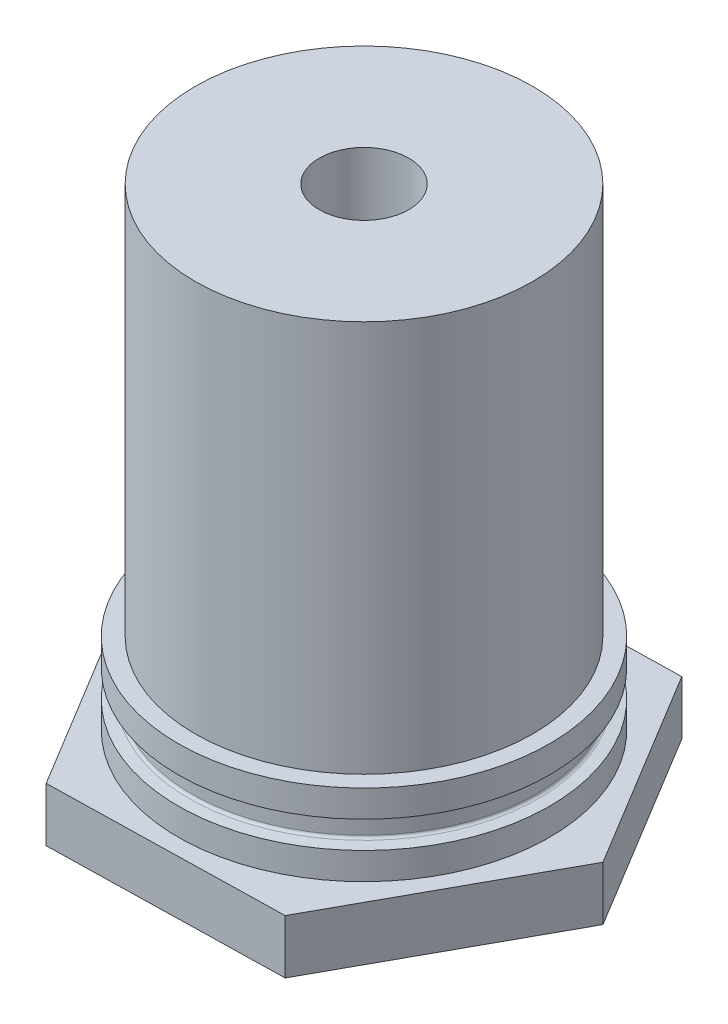
ISO-10303-21;
HEADER;
FILE_DESCRIPTION(('STEP AP214'),'2;1');
FILE_NAME('part.step','',(''),(''),'','','');
FILE_SCHEMA(('AUTOMOTIVE_DESIGN { 1 0 10303 214 1 1 1 1 }'));
ENDSEC;
DATA;
#1=APPLICATION_CONTEXT('core data for automotive mechanical design processes');
#2=APPLICATION_PROTOCOL_DEFINITION('international standard','automotive_design',2000,#1);
#3=PRODUCT_CONTEXT('',#1,'mechanical');
#4=PRODUCT('Part','Part','',(#3));
#5=PRODUCT_RELATED_PRODUCT_CATEGORY('part','',(#4));
#6=PRODUCT_DEFINITION_FORMATION('','',#4);
#7=PRODUCT_DEFINITION_CONTEXT('part definition',#1,'design');
#8=PRODUCT_DEFINITION('design','',#6,#7);
#9=PRODUCT_DEFINITION_SHAPE('','',#8);
#10=(LENGTH_UNIT() NAMED_UNIT(*) SI_UNIT(.MILLI.,.METRE.));
#11=(NAMED_UNIT(*) PLANE_ANGLE_UNIT() SI_UNIT($,.RADIAN.));
#12=(NAMED_UNIT(*) SI_UNIT($,.STERADIAN.) SOLID_ANGLE_UNIT());
#13=UNCERTAINTY_MEASURE_WITH_UNIT(LENGTH_MEASURE(1.E-05),#10,'distance_accuracy_value','');
#14=(GEOMETRIC_REPRESENTATION_CONTEXT(3) GLOBAL_UNCERTAINTY_ASSIGNED_CONTEXT((#13)) GLOBAL_UNIT_ASSIGNED_CONTEXT((#10,
#11,#12)) REPRESENTATION_CONTEXT('',''));
#15=CARTESIAN_POINT('',(0.,0.,0.));
#16=DIRECTION('',(0.,0.,1.));
#17=DIRECTION('',(1.,0.,0.));
#18=AXIS2_PLACEMENT_3D('',#15,#16,#17);
#19=CARTESIAN_POINT('',(0.,110.151211274222,0.));
#20=DIRECTION('',(0.,1.,0.));
#21=DIRECTION('',(0.,0.,1.));
#22=AXIS2_PLACEMENT_3D('',#19,#20,#21);
#23=CYLINDRICAL_SURFACE('',#22,17.4625);
#24=CARTESIAN_POINT('',(0.,5.08192526756477,0.));
#25=DIRECTION('',(0.,1.,0.));
#26=DIRECTION('',(0.,0.,1.));
#27=AXIS2_PLACEMENT_3D('',#24,#25,#26);
#28=CIRCLE('',#27,17.4625);
#29=CARTESIAN_POINT('',(0.,5.08192526756477,17.4625));
#30=VERTEX_POINT('',#29);
#31=EDGE_CURVE('E40',#30,#30,#28,.F.);
#32=ORIENTED_EDGE('',*,*,#31,.F.);
#33=EDGE_LOOP('',(#32));
#34=FACE_BOUND('',#33,.T.);
#35=CARTESIAN_POINT('',(0.,7.62,0.));
#36=DIRECTION('',(0.,1.,0.));
#37=DIRECTION('',(0.,0.,1.));
#38=AXIS2_PLACEMENT_3D('',#35,#36,#37);
#39=CIRCLE('',#38,17.4625);
#40=CARTESIAN_POINT('',(0.,7.62,17.4625));
#41=VERTEX_POINT('',#40);
#42=EDGE_CURVE('E153',#41,#41,#39,.T.);
#43=ORIENTED_EDGE('',*,*,#42,.F.);
#44=EDGE_LOOP('',(#43));
#45=FACE_BOUND('',#44,.T.);
#46=ADVANCED_FACE('F36',(#34,#45),#23,.T.);
#47=CARTESIAN_POINT('',(0.,110.151211274222,0.));
#48=DIRECTION('',(0.,1.,0.));
#49=DIRECTION('',(0.,0.,1.));
#50=AXIS2_PLACEMENT_3D('',#47,#48,#49);
#51=CYLINDRICAL_SURFACE('',#50,4.2037);
#52=CARTESIAN_POINT('',(0.,44.45,0.));
#53=DIRECTION('',(0.,1.,0.));
#54=DIRECTION('',(0.,0.,1.));
#55=AXIS2_PLACEMENT_3D('',#52,#53,#54);
#56=CIRCLE('',#55,4.2037);
#57=CARTESIAN_POINT('',(0.,44.45,4.2037));
#58=VERTEX_POINT('',#57);
#59=EDGE_CURVE('E11',#58,#58,#56,.T.);
#60=ORIENTED_EDGE('',*,*,#59,.T.);
#61=EDGE_LOOP('',(#60));
#62=FACE_BOUND('',#61,.T.);
#63=CARTESIAN_POINT('',(0.,37.846,0.));
#64=DIRECTION('',(0.,1.,0.));
#65=DIRECTION('',(0.,0.,1.));
#66=AXIS2_PLACEMENT_3D('',#63,#64,#65);
#67=CIRCLE('',#66,4.2037);
#68=CARTESIAN_POINT('',(0.,37.846,4.2037));
#69=VERTEX_POINT('',#68);
#70=EDGE_CURVE('E147',#69,#69,#67,.T.);
#71=ORIENTED_EDGE('',*,*,#70,.F.);
#72=EDGE_LOOP('',(#71));
#73=FACE_BOUND('',#72,.T.);
#74=ADVANCED_FACE('F38',(#62,#73),#51,.F.);
#75=CARTESIAN_POINT('',(-15.875,44.45,0.));
#76=DIRECTION('',(0.,1.,0.));
#77=DIRECTION('',(0.,0.,1.));
#78=AXIS2_PLACEMENT_3D('',#75,#76,#77);
#79=PLANE('',#78);
#80=CARTESIAN_POINT('',(0.,44.45,0.));
#81=DIRECTION('',(0.,1.,0.));
#82=DIRECTION('',(0.,0.,1.));
#83=AXIS2_PLACEMENT_3D('',#80,#81,#82);
#84=CIRCLE('',#83,15.875);
#85=CARTESIAN_POINT('',(0.,44.45,15.875));
#86=VERTEX_POINT('',#85);
#87=EDGE_CURVE('E46',#86,#86,#84,.T.);
#88=ORIENTED_EDGE('',*,*,#87,.T.);
#89=EDGE_LOOP('',(#88));
#90=FACE_BOUND('',#89,.T.);
#91=ORIENTED_EDGE('',*,*,#59,.F.);
#92=EDGE_LOOP('',(#91));
#93=FACE_BOUND('',#92,.T.);
#94=ADVANCED_FACE('F211',(#90,#93),#79,.T.);
#95=CARTESIAN_POINT('',(0.,110.151211274222,0.));
#96=DIRECTION('',(0.,1.,0.));
#97=DIRECTION('',(0.,0.,1.));
#98=AXIS2_PLACEMENT_3D('',#95,#96,#97);
#99=CYLINDRICAL_SURFACE('',#98,15.875);
#100=CARTESIAN_POINT('',(0.,7.62,0.));
#101=DIRECTION('',(0.,1.,0.));
#102=DIRECTION('',(0.,0.,1.));
#103=AXIS2_PLACEMENT_3D('',#100,#101,#102);
#104=CIRCLE('',#103,15.875);
#105=CARTESIAN_POINT('',(0.,7.62,15.875));
#106=VERTEX_POINT('',#105);
#107=EDGE_CURVE('E156',#106,#106,#104,.T.);
#108=ORIENTED_EDGE('',*,*,#107,.T.);
#109=EDGE_LOOP('',(#108));
#110=FACE_BOUND('',#109,.T.);
#111=ORIENTED_EDGE('',*,*,#87,.F.);
#112=EDGE_LOOP('',(#111));
#113=FACE_BOUND('',#112,.T.);
#114=ADVANCED_FACE('F227',(#110,#113),#99,.T.);
#115=CARTESIAN_POINT('',(-15.875,7.62,0.));
#116=DIRECTION('',(0.,1.,0.));
#117=DIRECTION('',(0.,0.,1.));
#118=AXIS2_PLACEMENT_3D('',#115,#116,#117);
#119=PLANE('',#118);
#120=ORIENTED_EDGE('',*,*,#42,.T.);
#121=EDGE_LOOP('',(#120));
#122=FACE_BOUND('',#121,.T.);
#123=ORIENTED_EDGE('',*,*,#107,.F.);
#124=EDGE_LOOP('',(#123));
#125=FACE_BOUND('',#124,.T.);
#126=ADVANCED_FACE('F219',(#122,#125),#119,.T.);
#127=CARTESIAN_POINT('',(0.,2.53807473243525,0.));
#128=DIRECTION('',(0.,-1.,0.));
#129=DIRECTION('',(0.,0.,-1.));
#130=AXIS2_PLACEMENT_3D('',#127,#128,#129);
#131=CIRCLE('',#130,17.4625);
#132=CARTESIAN_POINT('',(0.,2.53807473243525,-17.4625));
#133=VERTEX_POINT('',#132);
#134=EDGE_CURVE('E160',#133,#133,#131,.F.);
#135=ORIENTED_EDGE('',*,*,#134,.F.);
#136=EDGE_LOOP('',(#135));
#137=FACE_BOUND('',#136,.T.);
#138=CARTESIAN_POINT('',(0.,0.,0.));
#139=DIRECTION('',(0.,-1.,0.));
#140=DIRECTION('',(0.,0.,-1.));
#141=AXIS2_PLACEMENT_3D('',#138,#139,#140);
#142=CIRCLE('',#141,17.4625);
#143=CARTESIAN_POINT('',(0.,0.,-17.4625));
#144=VERTEX_POINT('',#143);
#145=EDGE_CURVE('E144',#144,#144,#142,.F.);
#146=ORIENTED_EDGE('',*,*,#145,.T.);
#147=EDGE_LOOP('',(#146));
#148=FACE_BOUND('',#147,.T.);
#149=ADVANCED_FACE('F207',(#137,#148),#23,.T.);
#150=CARTESIAN_POINT('',(0.,36.6395,0.));
#151=DIRECTION('',(0.,1.,0.));
#152=DIRECTION('',(0.,0.,1.));
#153=AXIS2_PLACEMENT_3D('',#150,#151,#152);
#154=CONICAL_SURFACE('',#153,2.2098,0.785398163397448);
#155=CARTESIAN_POINT('',(0.,37.846,0.));
#156=DIRECTION('',(0.,1.,0.));
#157=DIRECTION('',(0.,0.,1.));
#158=AXIS2_PLACEMENT_3D('',#155,#156,#157);
#159=CIRCLE('',#158,3.4163);
#160=CARTESIAN_POINT('',(0.,37.846,3.4163));
#161=VERTEX_POINT('',#160);
#162=EDGE_CURVE('E150',#161,#161,#159,.T.);
#163=ORIENTED_EDGE('',*,*,#162,.T.);
#164=EDGE_LOOP('',(#163));
#165=FACE_BOUND('',#164,.T.);
#166=CARTESIAN_POINT('',(0.,36.6395,0.));
#167=DIRECTION('',(0.,1.,0.));
#168=DIRECTION('',(0.,0.,1.));
#169=AXIS2_PLACEMENT_3D('',#166,#167,#168);
#170=CIRCLE('',#169,2.20979999999997);
#171=CARTESIAN_POINT('',(0.,36.6395,2.20979999999997));
#172=VERTEX_POINT('',#171);
#173=EDGE_CURVE('E166',#172,#172,#170,.T.);
#174=ORIENTED_EDGE('',*,*,#173,.F.);
#175=EDGE_LOOP('',(#174));
#176=FACE_BOUND('',#175,.T.);
#177=ADVANCED_FACE('F218',(#165,#176),#154,.F.);
#178=CARTESIAN_POINT('',(-4.2037,37.846,0.));
#179=DIRECTION('',(0.,1.,0.));
#180=DIRECTION('',(0.,0.,1.));
#181=AXIS2_PLACEMENT_3D('',#178,#179,#180);
#182=PLANE('',#181);
#183=ORIENTED_EDGE('',*,*,#70,.T.);
#184=EDGE_LOOP('',(#183));
#185=FACE_BOUND('',#184,.T.);
#186=ORIENTED_EDGE('',*,*,#162,.F.);
#187=EDGE_LOOP('',(#186));
#188=FACE_BOUND('',#187,.T.);
#189=ADVANCED_FACE('F225',(#185,#188),#182,.T.);
#190=CARTESIAN_POINT('',(-10.5891393054103,-5.08,19.2805634972273));
#191=DIRECTION('',(0.855148733490636,0.,-0.518382719242609));
#192=DIRECTION('',(-0.518382719242609,0.,-0.855148733490636));
#193=AXIS2_PLACEMENT_3D('',#190,#191,#192);
#194=PLANE('',#193);
#195=DIRECTION('',(-0.518382719242609,0.,-0.855148733490636));
#196=VECTOR('',#195,1.);
#197=CARTESIAN_POINT('',(-10.5891393054103,0.,19.2805634972273));
#198=LINE('',#197,#196);
#199=CARTESIAN_POINT('',(-10.5891393054103,0.,19.2805634972273));
#200=VERTEX_POINT('',#199);
#201=CARTESIAN_POINT('',(-21.9920274405829,0.,0.469818105916068));
#202=VERTEX_POINT('',#201);
#203=EDGE_CURVE('E124',#200,#202,#198,.T.);
#204=ORIENTED_EDGE('',*,*,#203,.T.);
#205=DIRECTION('',(0.,1.,0.));
#206=VECTOR('',#205,1.);
#207=CARTESIAN_POINT('',(-21.9920274405829,-5.08,0.469818105916068));
#208=LINE('',#207,#206);
#209=CARTESIAN_POINT('',(-21.9920274405829,-5.08,0.469818105916068));
#210=VERTEX_POINT('',#209);
#211=EDGE_CURVE('E142',#210,#202,#208,.T.);
#212=ORIENTED_EDGE('',*,*,#211,.F.);
#213=DIRECTION('',(-0.518382719242609,0.,-0.855148733490636));
#214=VECTOR('',#213,1.);
#215=CARTESIAN_POINT('',(-10.5891393054103,-5.08,19.2805634972273));
#216=LINE('',#215,#214);
#217=CARTESIAN_POINT('',(-10.5891393054103,-5.08,19.2805634972273));
#218=VERTEX_POINT('',#217);
#219=EDGE_CURVE('E135',#218,#210,#216,.T.);
#220=ORIENTED_EDGE('',*,*,#219,.F.);
#221=DIRECTION('',(0.,1.,0.));
#222=VECTOR('',#221,1.);
#223=CARTESIAN_POINT('',(-10.5891393054103,-5.08,19.2805634972273));
#224=LINE('',#223,#222);
#225=EDGE_CURVE('E120',#218,#200,#224,.T.);
#226=ORIENTED_EDGE('',*,*,#225,.T.);
#227=EDGE_LOOP('',(#204,#212,#220,#226));
#228=FACE_BOUND('',#227,.T.);
#229=ADVANCED_FACE('F192',(#228),#194,.F.);
#230=CARTESIAN_POINT('',(-21.9920274405829,-5.08,0.469818105916068));
#231=DIRECTION('',(0.876506970492274,0.,0.481389167595674));
#232=DIRECTION('',(0.481389167595675,0.,-0.876506970492274));
#233=AXIS2_PLACEMENT_3D('',#230,#231,#232);
#234=PLANE('',#233);
#235=DIRECTION('',(0.481389167595675,0.,-0.876506970492274));
#236=VECTOR('',#235,1.);
#237=CARTESIAN_POINT('',(-21.9920274405829,0.,0.469818105916068));
#238=LINE('',#237,#236);
#239=CARTESIAN_POINT('',(-11.4028881351727,0.,-18.8107453913113));
#240=VERTEX_POINT('',#239);
#241=EDGE_CURVE('E127',#202,#240,#238,.T.);
#242=ORIENTED_EDGE('',*,*,#241,.T.);
#243=DIRECTION('',(0.,1.,0.));
#244=VECTOR('',#243,1.);
#245=CARTESIAN_POINT('',(-11.4028881351727,-5.08,-18.8107453913113));
#246=LINE('',#245,#244);
#247=CARTESIAN_POINT('',(-11.4028881351727,-5.08,-18.8107453913113));
#248=VERTEX_POINT('',#247);
#249=EDGE_CURVE('E139',#248,#240,#246,.T.);
#250=ORIENTED_EDGE('',*,*,#249,.F.);
#251=DIRECTION('',(0.481389167595675,0.,-0.876506970492274));
#252=VECTOR('',#251,1.);
#253=CARTESIAN_POINT('',(-21.9920274405829,-5.08,0.469818105916068));
#254=LINE('',#253,#252);
#255=EDGE_CURVE('E93',#210,#248,#254,.T.);
#256=ORIENTED_EDGE('',*,*,#255,.F.);
#257=ORIENTED_EDGE('',*,*,#211,.T.);
#258=EDGE_LOOP('',(#242,#250,#256,#257));
#259=FACE_BOUND('',#258,.T.);
#260=ADVANCED_FACE('F184',(#259),#234,.F.);
#261=CARTESIAN_POINT('',(-11.4028881351727,-5.08,-18.8107453913113));
#262=DIRECTION('',(0.0213582370016381,0.,0.999771886838284));
#263=DIRECTION('',(0.999771886838284,0.,-0.0213582370016381));
#264=AXIS2_PLACEMENT_3D('',#261,#262,#263);
#265=PLANE('',#264);
#266=DIRECTION('',(0.999771886838284,0.,-0.0213582370016381));
#267=VECTOR('',#266,1.);
#268=CARTESIAN_POINT('',(-11.4028881351727,0.,-18.8107453913113));
#269=LINE('',#268,#267);
#270=CARTESIAN_POINT('',(10.5891393054103,0.,-19.2805634972273));
#271=VERTEX_POINT('',#270);
#272=EDGE_CURVE('E130',#240,#271,#269,.T.);
#273=ORIENTED_EDGE('',*,*,#272,.T.);
#274=DIRECTION('',(0.,1.,0.));
#275=VECTOR('',#274,1.);
#276=CARTESIAN_POINT('',(10.5891393054103,-5.08,-19.2805634972273));
#277=LINE('',#276,#275);
#278=CARTESIAN_POINT('',(10.5891393054103,-5.08,-19.2805634972273));
#279=VERTEX_POINT('',#278);
#280=EDGE_CURVE('E115',#279,#271,#277,.T.);
#281=ORIENTED_EDGE('',*,*,#280,.F.);
#282=DIRECTION('',(0.999771886838284,0.,-0.0213582370016381));
#283=VECTOR('',#282,1.);
#284=CARTESIAN_POINT('',(-11.4028881351727,-5.08,-18.8107453913113));
#285=LINE('',#284,#283);
#286=EDGE_CURVE('E106',#248,#279,#285,.T.);
#287=ORIENTED_EDGE('',*,*,#286,.F.);
#288=ORIENTED_EDGE('',*,*,#249,.T.);
#289=EDGE_LOOP('',(#273,#281,#287,#288));
#290=FACE_BOUND('',#289,.T.);
#291=ADVANCED_FACE('F187',(#290),#265,.F.);
#292=CARTESIAN_POINT('',(10.5891393054103,-5.08,-19.2805634972273));
#293=DIRECTION('',(-0.855148733490635,0.,0.518382719242609));
#294=DIRECTION('',(0.518382719242609,0.,0.855148733490636));
#295=AXIS2_PLACEMENT_3D('',#292,#293,#294);
#296=PLANE('',#295);
#297=DIRECTION('',(0.518382719242609,0.,0.855148733490636));
#298=VECTOR('',#297,1.);
#299=CARTESIAN_POINT('',(10.5891393054103,0.,-19.2805634972273));
#300=LINE('',#299,#298);
#301=CARTESIAN_POINT('',(21.9920274405829,0.,-0.469818105916082));
#302=VERTEX_POINT('',#301);
#303=EDGE_CURVE('E114',#271,#302,#300,.T.);
#304=ORIENTED_EDGE('',*,*,#303,.T.);
#305=DIRECTION('',(0.,1.,0.));
#306=VECTOR('',#305,1.);
#307=CARTESIAN_POINT('',(21.9920274405829,-5.08,-0.469818105916082));
#308=LINE('',#307,#306);
#309=CARTESIAN_POINT('',(21.9920274405829,-5.08,-0.469818105916082));
#310=VERTEX_POINT('',#309);
#311=EDGE_CURVE('E111',#310,#302,#308,.T.);
#312=ORIENTED_EDGE('',*,*,#311,.F.);
#313=DIRECTION('',(0.518382719242609,0.,0.855148733490636));
#314=VECTOR('',#313,1.);
#315=CARTESIAN_POINT('',(10.5891393054103,-5.08,-19.2805634972273));
#316=LINE('',#315,#314);
#317=EDGE_CURVE('E100',#279,#310,#316,.T.);
#318=ORIENTED_EDGE('',*,*,#317,.F.);
#319=ORIENTED_EDGE('',*,*,#280,.T.);
#320=EDGE_LOOP('',(#304,#312,#318,#319));
#321=FACE_BOUND('',#320,.T.);
#322=ADVANCED_FACE('F112',(#321),#296,.F.);
#323=CARTESIAN_POINT('',(21.9920274405829,-5.08,-0.469818105916082));
#324=DIRECTION('',(-0.876506970492274,0.,-0.481389167595674));
#325=DIRECTION('',(-0.481389167595674,0.,0.876506970492274));
#326=AXIS2_PLACEMENT_3D('',#323,#324,#325);
#327=PLANE('',#326);
#328=DIRECTION('',(-0.481389167595674,0.,0.876506970492274));
#329=VECTOR('',#328,1.);
#330=CARTESIAN_POINT('',(21.9920274405829,0.,-0.469818105916082));
#331=LINE('',#330,#329);
#332=CARTESIAN_POINT('',(11.4028881351727,0.,18.8107453913113));
#333=VERTEX_POINT('',#332);
#334=EDGE_CURVE('E78',#302,#333,#331,.T.);
#335=ORIENTED_EDGE('',*,*,#334,.T.);
#336=DIRECTION('',(0.,1.,0.));
#337=VECTOR('',#336,1.);
#338=CARTESIAN_POINT('',(11.4028881351727,-5.08,18.8107453913113));
#339=LINE('',#338,#337);
#340=CARTESIAN_POINT('',(11.4028881351727,-5.08,18.8107453913113));
#341=VERTEX_POINT('',#340);
#342=EDGE_CURVE('E116',#341,#333,#339,.T.);
#343=ORIENTED_EDGE('',*,*,#342,.F.);
#344=DIRECTION('',(-0.481389167595674,0.,0.876506970492274));
#345=VECTOR('',#344,1.);
#346=CARTESIAN_POINT('',(21.9920274405829,-5.08,-0.469818105916082));
#347=LINE('',#346,#345);
#348=EDGE_CURVE('E104',#310,#341,#347,.T.);
#349=ORIENTED_EDGE('',*,*,#348,.F.);
#350=ORIENTED_EDGE('',*,*,#311,.T.);
#351=EDGE_LOOP('',(#335,#343,#349,#350));
#352=FACE_BOUND('',#351,.T.);
#353=ADVANCED_FACE('F118',(#352),#327,.F.);
#354=CARTESIAN_POINT('',(11.4028881351727,-5.08,18.8107453913113));
#355=DIRECTION('',(-0.0213582370016381,0.,-0.999771886838284));
#356=DIRECTION('',(-0.999771886838284,0.,0.0213582370016381));
#357=AXIS2_PLACEMENT_3D('',#354,#355,#356);
#358=PLANE('',#357);
#359=DIRECTION('',(-0.999771886838284,0.,0.0213582370016381));
#360=VECTOR('',#359,1.);
#361=CARTESIAN_POINT('',(11.4028881351727,0.,18.8107453913113));
#362=LINE('',#361,#360);
#363=EDGE_CURVE('E84',#333,#200,#362,.T.);
#364=ORIENTED_EDGE('',*,*,#363,.T.);
#365=ORIENTED_EDGE('',*,*,#225,.F.);
#366=DIRECTION('',(-0.999771886838284,0.,0.0213582370016381));
#367=VECTOR('',#366,1.);
#368=CARTESIAN_POINT('',(11.4028881351727,-5.08,18.8107453913113));
#369=LINE('',#368,#367);
#370=EDGE_CURVE('E55',#341,#218,#369,.T.);
#371=ORIENTED_EDGE('',*,*,#370,.F.);
#372=ORIENTED_EDGE('',*,*,#342,.T.);
#373=EDGE_LOOP('',(#364,#365,#371,#372));
#374=FACE_BOUND('',#373,.T.);
#375=ADVANCED_FACE('F193',(#374),#358,.F.);
#376=CARTESIAN_POINT('',(0.,-5.08,0.));
#377=DIRECTION('',(0.,-1.,0.));
#378=DIRECTION('',(0.,0.,-1.));
#379=AXIS2_PLACEMENT_3D('',#376,#377,#378);
#380=PLANE('',#379);
#381=CARTESIAN_POINT('',(0.,-5.08,0.));
#382=DIRECTION('',(0.,1.,0.));
#383=DIRECTION('',(0.,0.,1.));
#384=AXIS2_PLACEMENT_3D('',#381,#382,#383);
#385=CIRCLE('',#384,2.20979999999997);
#386=CARTESIAN_POINT('',(0.,-5.08,2.20979999999997));
#387=VERTEX_POINT('',#386);
#388=EDGE_CURVE('E128',#387,#387,#385,.T.);
#389=ORIENTED_EDGE('',*,*,#388,.T.);
#390=EDGE_LOOP('',(#389));
#391=FACE_BOUND('',#390,.T.);
#392=ORIENTED_EDGE('',*,*,#219,.T.);
#393=ORIENTED_EDGE('',*,*,#255,.T.);
#394=ORIENTED_EDGE('',*,*,#286,.T.);
#395=ORIENTED_EDGE('',*,*,#317,.T.);
#396=ORIENTED_EDGE('',*,*,#348,.T.);
#397=ORIENTED_EDGE('',*,*,#370,.T.);
#398=EDGE_LOOP('',(#392,#393,#394,#395,#396,#397));
#399=FACE_BOUND('',#398,.T.);
#400=ADVANCED_FACE('F102',(#391,#399),#380,.T.);
#401=CARTESIAN_POINT('',(0.,0.,0.));
#402=DIRECTION('',(0.,-1.,0.));
#403=DIRECTION('',(0.,0.,-1.));
#404=AXIS2_PLACEMENT_3D('',#401,#402,#403);
#405=PLANE('',#404);
#406=ORIENTED_EDGE('',*,*,#145,.F.);
#407=EDGE_LOOP('',(#406));
#408=FACE_BOUND('',#407,.T.);
#409=ORIENTED_EDGE('',*,*,#203,.F.);
#410=ORIENTED_EDGE('',*,*,#363,.F.);
#411=ORIENTED_EDGE('',*,*,#334,.F.);
#412=ORIENTED_EDGE('',*,*,#303,.F.);
#413=ORIENTED_EDGE('',*,*,#272,.F.);
#414=ORIENTED_EDGE('',*,*,#241,.F.);
#415=EDGE_LOOP('',(#409,#410,#411,#412,#413,#414));
#416=FACE_BOUND('',#415,.T.);
#417=ADVANCED_FACE('F190',(#408,#416),#405,.F.);
#418=CARTESIAN_POINT('',(0.,-5.08,0.));
#419=DIRECTION('',(0.,1.,0.));
#420=DIRECTION('',(0.,0.,1.));
#421=AXIS2_PLACEMENT_3D('',#418,#419,#420);
#422=CYLINDRICAL_SURFACE('',#421,2.20979999999997);
#423=ORIENTED_EDGE('',*,*,#388,.F.);
#424=EDGE_LOOP('',(#423));
#425=FACE_BOUND('',#424,.T.);
#426=ORIENTED_EDGE('',*,*,#173,.T.);
#427=EDGE_LOOP('',(#426));
#428=FACE_BOUND('',#427,.T.);
#429=ADVANCED_FACE('F233',(#425,#428),#422,.F.);
#430=CARTESIAN_POINT('',(0.,4.73806654668468,0.));
#431=DIRECTION('',(0.,-1.,0.));
#432=DIRECTION('',(0.,0.,-1.));
#433=AXIS2_PLACEMENT_3D('',#430,#431,#432);
#434=TOROIDAL_SURFACE('',#433,16.4464999999804,0.254000000000006);
#435=CARTESIAN_POINT('',(0.,4.73806654668471,0.));
#436=DIRECTION('',(0.,-1.,0.));
#437=DIRECTION('',(0.,0.,-1.));
#438=AXIS2_PLACEMENT_3D('',#435,#436,#437);
#439=CIRCLE('',#438,16.1924999999804);
#440=CARTESIAN_POINT('',(0.,4.73806654668471,-16.1924999999804));
#441=VERTEX_POINT('',#440);
#442=EDGE_CURVE('E265',#441,#441,#439,.T.);
#443=ORIENTED_EDGE('',*,*,#442,.F.);
#444=EDGE_LOOP('',(#443));
#445=FACE_BOUND('',#444,.T.);
#446=CARTESIAN_POINT('',(0.,4.9911,0.));
#447=DIRECTION('',(0.,-1.,0.));
#448=DIRECTION('',(0.,0.,-1.));
#449=AXIS2_PLACEMENT_3D('',#446,#447,#448);
#450=CIRCLE('',#449,16.4243624413225);
#451=CARTESIAN_POINT('',(0.,4.9911,-16.4243624413225));
#452=VERTEX_POINT('',#451);
#453=EDGE_CURVE('E162',#452,#452,#450,.T.);
#454=ORIENTED_EDGE('',*,*,#453,.T.);
#455=EDGE_LOOP('',(#454));
#456=FACE_BOUND('',#455,.T.);
#457=ADVANCED_FACE('F237',(#445,#456),#434,.F.);
#458=CARTESIAN_POINT('',(0.,5.08970300975051,0.));
#459=DIRECTION('',(0.,1.,0.));
#460=DIRECTION('',(0.,0.,1.));
#461=AXIS2_PLACEMENT_3D('',#458,#459,#460);
#462=CONICAL_SURFACE('',#461,17.5513999999804,1.48352986419517);
#463=ORIENTED_EDGE('',*,*,#31,.T.);
#464=EDGE_LOOP('',(#463));
#465=FACE_BOUND('',#464,.T.);
#466=ORIENTED_EDGE('',*,*,#453,.F.);
#467=EDGE_LOOP('',(#466));
#468=FACE_BOUND('',#467,.T.);
#469=ADVANCED_FACE('F243',(#465,#468),#462,.T.);
#470=CARTESIAN_POINT('',(0.,2.62890000000002,0.));
#471=DIRECTION('',(0.,-1.,0.));
#472=DIRECTION('',(0.,0.,-1.));
#473=AXIS2_PLACEMENT_3D('',#470,#471,#472);
#474=CONICAL_SURFACE('',#473,16.4243624413225,1.48352986419517);
#475=ORIENTED_EDGE('',*,*,#134,.T.);
#476=EDGE_LOOP('',(#475));
#477=FACE_BOUND('',#476,.T.);
#478=CARTESIAN_POINT('',(0.,2.62890000000002,0.));
#479=DIRECTION('',(0.,-1.,0.));
#480=DIRECTION('',(0.,0.,-1.));
#481=AXIS2_PLACEMENT_3D('',#478,#479,#480);
#482=CIRCLE('',#481,16.4243624413225);
#483=CARTESIAN_POINT('',(0.,2.62890000000002,-16.4243624413225));
#484=VERTEX_POINT('',#483);
#485=EDGE_CURVE('E168',#484,#484,#482,.T.);
#486=ORIENTED_EDGE('',*,*,#485,.T.);
#487=EDGE_LOOP('',(#486));
#488=FACE_BOUND('',#487,.T.);
#489=ADVANCED_FACE('F247',(#477,#488),#474,.T.);
#490=CARTESIAN_POINT('',(0.,2.88193345331531,0.));
#491=DIRECTION('',(0.,-1.,0.));
#492=DIRECTION('',(0.,0.,-1.));
#493=AXIS2_PLACEMENT_3D('',#490,#491,#492);
#494=TOROIDAL_SURFACE('',#493,16.4464999999804,0.254);
#495=ORIENTED_EDGE('',*,*,#485,.F.);
#496=EDGE_LOOP('',(#495));
#497=FACE_BOUND('',#496,.T.);
#498=CARTESIAN_POINT('',(0.,2.88193345331531,0.));
#499=DIRECTION('',(0.,-1.,0.));
#500=DIRECTION('',(0.,0.,-1.));
#501=AXIS2_PLACEMENT_3D('',#498,#499,#500);
#502=CIRCLE('',#501,16.1924999999804);
#503=CARTESIAN_POINT('',(0.,2.8819334533153,-16.1924999999804));
#504=VERTEX_POINT('',#503);
#505=EDGE_CURVE('E173',#504,#504,#502,.T.);
#506=ORIENTED_EDGE('',*,*,#505,.T.);
#507=EDGE_LOOP('',(#506));
#508=FACE_BOUND('',#507,.T.);
#509=ADVANCED_FACE('F251',(#497,#508),#494,.F.);
#510=CARTESIAN_POINT('',(0.,160.151211274222,0.));
#511=DIRECTION('',(0.,-1.,0.));
#512=DIRECTION('',(0.,0.,-1.));
#513=AXIS2_PLACEMENT_3D('',#510,#511,#512);
#514=CYLINDRICAL_SURFACE('',#513,16.1924999999804);
#515=ORIENTED_EDGE('',*,*,#505,.F.);
#516=EDGE_LOOP('',(#515));
#517=FACE_BOUND('',#516,.T.);
#518=ORIENTED_EDGE('',*,*,#442,.T.);
#519=EDGE_LOOP('',(#518));
#520=FACE_BOUND('',#519,.T.);
#521=ADVANCED_FACE('F254',(#517,#520),#514,.T.);
#522=CLOSED_SHELL('',(#46,#74,#94,#114,#126,#149,#177,#189,#229,#260,#291,#322,#353,#375,#400,
#417,#429,#457,#469,#489,#509,#521));
#523=MANIFOLD_SOLID_BREP('B2',#522);
#524=ADVANCED_BREP_SHAPE_REPRESENTATION('',(#18,#523),#14);
#525=SHAPE_DEFINITION_REPRESENTATION(#9,#524);
ENDSEC;
END-ISO-10303-21;
